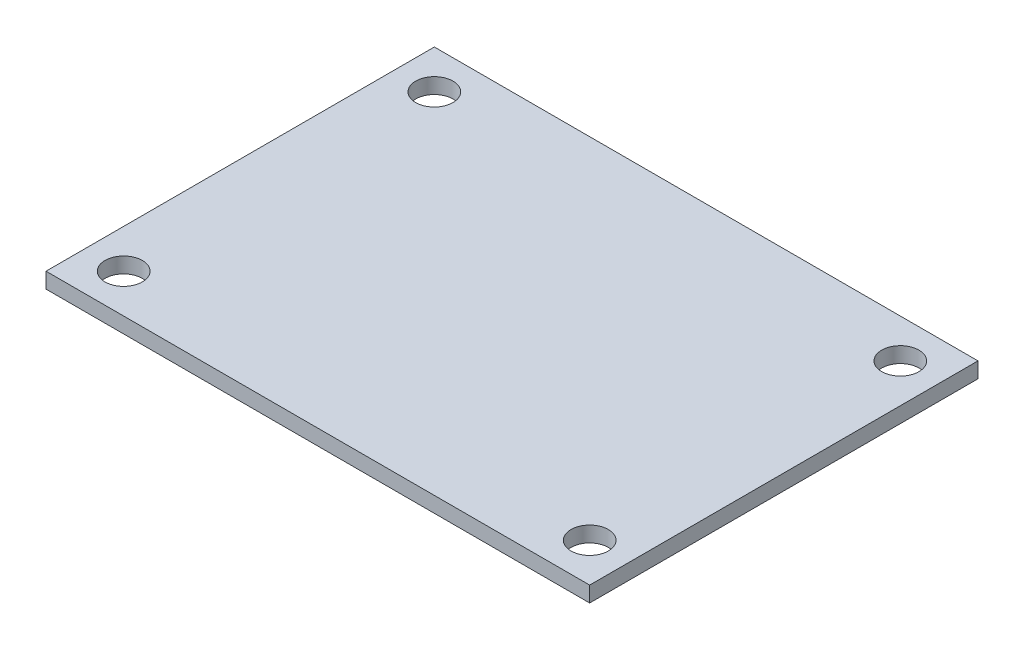
ISO-10303-21;
HEADER;
FILE_DESCRIPTION(('STEP AP214'),'2;1');
FILE_NAME('part.step','',(''),(''),'','','');
FILE_SCHEMA(('AUTOMOTIVE_DESIGN { 1 0 10303 214 1 1 1 1 }'));
ENDSEC;
DATA;
#1=APPLICATION_CONTEXT('core data for automotive mechanical design processes');
#2=APPLICATION_PROTOCOL_DEFINITION('international standard','automotive_design',2000,#1);
#3=PRODUCT_CONTEXT('',#1,'mechanical');
#4=PRODUCT('Part','Part','',(#3));
#5=PRODUCT_RELATED_PRODUCT_CATEGORY('part','',(#4));
#6=PRODUCT_DEFINITION_FORMATION('','',#4);
#7=PRODUCT_DEFINITION_CONTEXT('part definition',#1,'design');
#8=PRODUCT_DEFINITION('design','',#6,#7);
#9=PRODUCT_DEFINITION_SHAPE('','',#8);
#10=(LENGTH_UNIT() NAMED_UNIT(*) SI_UNIT(.MILLI.,.METRE.));
#11=(NAMED_UNIT(*) PLANE_ANGLE_UNIT() SI_UNIT($,.RADIAN.));
#12=(NAMED_UNIT(*) SI_UNIT($,.STERADIAN.) SOLID_ANGLE_UNIT());
#13=UNCERTAINTY_MEASURE_WITH_UNIT(LENGTH_MEASURE(1.E-05),#10,'distance_accuracy_value','');
#14=(GEOMETRIC_REPRESENTATION_CONTEXT(3) GLOBAL_UNCERTAINTY_ASSIGNED_CONTEXT((#13)) GLOBAL_UNIT_ASSIGNED_CONTEXT((#10,
#11,#12)) REPRESENTATION_CONTEXT('',''));
#15=CARTESIAN_POINT('',(0.,0.,0.));
#16=DIRECTION('',(0.,0.,1.));
#17=DIRECTION('',(1.,0.,0.));
#18=AXIS2_PLACEMENT_3D('',#15,#16,#17);
#19=CARTESIAN_POINT('',(15.,-0.000999999999999916,10.));
#20=DIRECTION('',(0.,1.,0.));
#21=DIRECTION('',(0.,0.,1.));
#22=AXIS2_PLACEMENT_3D('',#19,#20,#21);
#23=CYLINDRICAL_SURFACE('',#22,1.2);
#24=CARTESIAN_POINT('',(15.,1.,10.));
#25=DIRECTION('',(0.,1.,0.));
#26=DIRECTION('',(0.,0.,1.));
#27=AXIS2_PLACEMENT_3D('',#24,#25,#26);
#28=CIRCLE('',#27,1.2);
#29=CARTESIAN_POINT('',(15.,1.,11.2));
#30=VERTEX_POINT('',#29);
#31=EDGE_CURVE('E43',#30,#30,#28,.T.);
#32=ORIENTED_EDGE('',*,*,#31,.T.);
#33=EDGE_LOOP('',(#32));
#34=FACE_BOUND('',#33,.T.);
#35=CARTESIAN_POINT('',(15.,0.,10.));
#36=DIRECTION('',(0.,1.,0.));
#37=DIRECTION('',(0.,0.,1.));
#38=AXIS2_PLACEMENT_3D('',#35,#36,#37);
#39=CIRCLE('',#38,1.2);
#40=CARTESIAN_POINT('',(15.,0.,11.2));
#41=VERTEX_POINT('',#40);
#42=EDGE_CURVE('E11',#41,#41,#39,.F.);
#43=ORIENTED_EDGE('',*,*,#42,.T.);
#44=EDGE_LOOP('',(#43));
#45=FACE_BOUND('',#44,.T.);
#46=ADVANCED_FACE('F35',(#34,#45),#23,.F.);
#47=CARTESIAN_POINT('',(-15.,-0.000999999999999916,10.));
#48=DIRECTION('',(0.,1.,0.));
#49=DIRECTION('',(0.,0.,1.));
#50=AXIS2_PLACEMENT_3D('',#47,#48,#49);
#51=CYLINDRICAL_SURFACE('',#50,1.2);
#52=CARTESIAN_POINT('',(-15.,1.,10.));
#53=DIRECTION('',(0.,1.,0.));
#54=DIRECTION('',(0.,0.,1.));
#55=AXIS2_PLACEMENT_3D('',#52,#53,#54);
#56=CIRCLE('',#55,1.2);
#57=CARTESIAN_POINT('',(-15.,1.,11.2));
#58=VERTEX_POINT('',#57);
#59=EDGE_CURVE('E113',#58,#58,#56,.T.);
#60=ORIENTED_EDGE('',*,*,#59,.T.);
#61=EDGE_LOOP('',(#60));
#62=FACE_BOUND('',#61,.T.);
#63=CARTESIAN_POINT('',(-15.,0.,10.));
#64=DIRECTION('',(0.,1.,0.));
#65=DIRECTION('',(0.,0.,1.));
#66=AXIS2_PLACEMENT_3D('',#63,#64,#65);
#67=CIRCLE('',#66,1.2);
#68=CARTESIAN_POINT('',(-15.,0.,11.2));
#69=VERTEX_POINT('',#68);
#70=EDGE_CURVE('E116',#69,#69,#67,.F.);
#71=ORIENTED_EDGE('',*,*,#70,.T.);
#72=EDGE_LOOP('',(#71));
#73=FACE_BOUND('',#72,.T.);
#74=ADVANCED_FACE('F140',(#62,#73),#51,.F.);
#75=CARTESIAN_POINT('',(17.5,1.,-12.5));
#76=DIRECTION('',(-1.,0.,0.));
#77=DIRECTION('',(0.,0.,1.));
#78=AXIS2_PLACEMENT_3D('',#75,#76,#77);
#79=PLANE('',#78);
#80=DIRECTION('',(0.,0.,-1.));
#81=VECTOR('',#80,1.);
#82=CARTESIAN_POINT('',(17.5,0.,-12.5));
#83=LINE('',#82,#81);
#84=CARTESIAN_POINT('',(17.5,0.,12.5));
#85=VERTEX_POINT('',#84);
#86=CARTESIAN_POINT('',(17.5,0.,-12.5));
#87=VERTEX_POINT('',#86);
#88=EDGE_CURVE('E103',#85,#87,#83,.T.);
#89=ORIENTED_EDGE('',*,*,#88,.T.);
#90=DIRECTION('',(0.,-1.,0.));
#91=VECTOR('',#90,1.);
#92=CARTESIAN_POINT('',(17.5,1.,-12.5));
#93=LINE('',#92,#91);
#94=CARTESIAN_POINT('',(17.5,1.,-12.5));
#95=VERTEX_POINT('',#94);
#96=EDGE_CURVE('E94',#95,#87,#93,.T.);
#97=ORIENTED_EDGE('',*,*,#96,.F.);
#98=DIRECTION('',(0.,0.,-1.));
#99=VECTOR('',#98,1.);
#100=CARTESIAN_POINT('',(17.5,1.,-12.5));
#101=LINE('',#100,#99);
#102=CARTESIAN_POINT('',(17.5,1.,12.5));
#103=VERTEX_POINT('',#102);
#104=EDGE_CURVE('E88',#103,#95,#101,.T.);
#105=ORIENTED_EDGE('',*,*,#104,.F.);
#106=DIRECTION('',(0.,-1.,0.));
#107=VECTOR('',#106,1.);
#108=CARTESIAN_POINT('',(17.5,1.,12.5));
#109=LINE('',#108,#107);
#110=EDGE_CURVE('E99',#103,#85,#109,.T.);
#111=ORIENTED_EDGE('',*,*,#110,.T.);
#112=EDGE_LOOP('',(#89,#97,#105,#111));
#113=FACE_BOUND('',#112,.T.);
#114=ADVANCED_FACE('F144',(#113),#79,.F.);
#115=CARTESIAN_POINT('',(-17.5,1.,-12.5));
#116=DIRECTION('',(0.,0.,1.));
#117=DIRECTION('',(1.,0.,0.));
#118=AXIS2_PLACEMENT_3D('',#115,#116,#117);
#119=PLANE('',#118);
#120=DIRECTION('',(-1.,0.,0.));
#121=VECTOR('',#120,1.);
#122=CARTESIAN_POINT('',(-17.5,0.,-12.5));
#123=LINE('',#122,#121);
#124=CARTESIAN_POINT('',(-17.5,0.,-12.5));
#125=VERTEX_POINT('',#124);
#126=EDGE_CURVE('E93',#87,#125,#123,.T.);
#127=ORIENTED_EDGE('',*,*,#126,.T.);
#128=DIRECTION('',(0.,-1.,0.));
#129=VECTOR('',#128,1.);
#130=CARTESIAN_POINT('',(-17.5,1.,-12.5));
#131=LINE('',#130,#129);
#132=CARTESIAN_POINT('',(-17.5,1.,-12.5));
#133=VERTEX_POINT('',#132);
#134=EDGE_CURVE('E91',#133,#125,#131,.T.);
#135=ORIENTED_EDGE('',*,*,#134,.F.);
#136=DIRECTION('',(-1.,0.,0.));
#137=VECTOR('',#136,1.);
#138=CARTESIAN_POINT('',(-17.5,1.,-12.5));
#139=LINE('',#138,#137);
#140=EDGE_CURVE('E82',#95,#133,#139,.T.);
#141=ORIENTED_EDGE('',*,*,#140,.F.);
#142=ORIENTED_EDGE('',*,*,#96,.T.);
#143=EDGE_LOOP('',(#127,#135,#141,#142));
#144=FACE_BOUND('',#143,.T.);
#145=ADVANCED_FACE('F92',(#144),#119,.F.);
#146=CARTESIAN_POINT('',(-17.5,1.,-12.5));
#147=DIRECTION('',(1.,0.,0.));
#148=DIRECTION('',(0.,0.,-1.));
#149=AXIS2_PLACEMENT_3D('',#146,#147,#148);
#150=PLANE('',#149);
#151=DIRECTION('',(0.,0.,1.));
#152=VECTOR('',#151,1.);
#153=CARTESIAN_POINT('',(-17.5,0.,-12.5));
#154=LINE('',#153,#152);
#155=CARTESIAN_POINT('',(-17.5,0.,12.5));
#156=VERTEX_POINT('',#155);
#157=EDGE_CURVE('E68',#125,#156,#154,.T.);
#158=ORIENTED_EDGE('',*,*,#157,.T.);
#159=DIRECTION('',(0.,-1.,0.));
#160=VECTOR('',#159,1.);
#161=CARTESIAN_POINT('',(-17.5,1.,12.5));
#162=LINE('',#161,#160);
#163=CARTESIAN_POINT('',(-17.5,1.,12.5));
#164=VERTEX_POINT('',#163);
#165=EDGE_CURVE('E95',#164,#156,#162,.T.);
#166=ORIENTED_EDGE('',*,*,#165,.F.);
#167=DIRECTION('',(0.,0.,1.));
#168=VECTOR('',#167,1.);
#169=CARTESIAN_POINT('',(-17.5,1.,-12.5));
#170=LINE('',#169,#168);
#171=EDGE_CURVE('E86',#133,#164,#170,.T.);
#172=ORIENTED_EDGE('',*,*,#171,.F.);
#173=ORIENTED_EDGE('',*,*,#134,.T.);
#174=EDGE_LOOP('',(#158,#166,#172,#173));
#175=FACE_BOUND('',#174,.T.);
#176=ADVANCED_FACE('F97',(#175),#150,.F.);
#177=CARTESIAN_POINT('',(-17.5,1.,12.5));
#178=DIRECTION('',(0.,0.,-1.));
#179=DIRECTION('',(-1.,0.,0.));
#180=AXIS2_PLACEMENT_3D('',#177,#178,#179);
#181=PLANE('',#180);
#182=DIRECTION('',(1.,0.,0.));
#183=VECTOR('',#182,1.);
#184=CARTESIAN_POINT('',(-17.5,0.,12.5));
#185=LINE('',#184,#183);
#186=EDGE_CURVE('E74',#156,#85,#185,.T.);
#187=ORIENTED_EDGE('',*,*,#186,.T.);
#188=ORIENTED_EDGE('',*,*,#110,.F.);
#189=DIRECTION('',(1.,0.,0.));
#190=VECTOR('',#189,1.);
#191=CARTESIAN_POINT('',(-17.5,1.,12.5));
#192=LINE('',#191,#190);
#193=EDGE_CURVE('E51',#164,#103,#192,.T.);
#194=ORIENTED_EDGE('',*,*,#193,.F.);
#195=ORIENTED_EDGE('',*,*,#165,.T.);
#196=EDGE_LOOP('',(#187,#188,#194,#195));
#197=FACE_BOUND('',#196,.T.);
#198=ADVANCED_FACE('F125',(#197),#181,.F.);
#199=CARTESIAN_POINT('',(0.,1.,0.));
#200=DIRECTION('',(0.,1.,0.));
#201=DIRECTION('',(0.,0.,1.));
#202=AXIS2_PLACEMENT_3D('',#199,#200,#201);
#203=PLANE('',#202);
#204=CARTESIAN_POINT('',(15.,1.,-10.));
#205=DIRECTION('',(0.,1.,0.));
#206=DIRECTION('',(0.,0.,1.));
#207=AXIS2_PLACEMENT_3D('',#204,#205,#206);
#208=CIRCLE('',#207,1.2);
#209=CARTESIAN_POINT('',(15.,1.,-8.8));
#210=VERTEX_POINT('',#209);
#211=EDGE_CURVE('E206',#210,#210,#208,.T.);
#212=ORIENTED_EDGE('',*,*,#211,.F.);
#213=EDGE_LOOP('',(#212));
#214=FACE_BOUND('',#213,.T.);
#215=CARTESIAN_POINT('',(-15.,1.,-10.));
#216=DIRECTION('',(0.,1.,0.));
#217=DIRECTION('',(0.,0.,1.));
#218=AXIS2_PLACEMENT_3D('',#215,#216,#217);
#219=CIRCLE('',#218,1.2);
#220=CARTESIAN_POINT('',(-15.,1.,-8.8));
#221=VERTEX_POINT('',#220);
#222=EDGE_CURVE('E210',#221,#221,#219,.T.);
#223=ORIENTED_EDGE('',*,*,#222,.F.);
#224=EDGE_LOOP('',(#223));
#225=FACE_BOUND('',#224,.T.);
#226=ORIENTED_EDGE('',*,*,#104,.T.);
#227=ORIENTED_EDGE('',*,*,#140,.T.);
#228=ORIENTED_EDGE('',*,*,#171,.T.);
#229=ORIENTED_EDGE('',*,*,#193,.T.);
#230=EDGE_LOOP('',(#226,#227,#228,#229));
#231=FACE_BOUND('',#230,.T.);
#232=ORIENTED_EDGE('',*,*,#59,.F.);
#233=EDGE_LOOP('',(#232));
#234=FACE_BOUND('',#233,.T.);
#235=ORIENTED_EDGE('',*,*,#31,.F.);
#236=EDGE_LOOP('',(#235));
#237=FACE_BOUND('',#236,.T.);
#238=ADVANCED_FACE('F83',(#214,#225,#231,#234,#237),#203,.T.);
#239=CARTESIAN_POINT('',(0.,0.,0.));
#240=DIRECTION('',(0.,1.,0.));
#241=DIRECTION('',(0.,0.,1.));
#242=AXIS2_PLACEMENT_3D('',#239,#240,#241);
#243=PLANE('',#242);
#244=CARTESIAN_POINT('',(15.,0.,-10.));
#245=DIRECTION('',(0.,1.,0.));
#246=DIRECTION('',(0.,0.,1.));
#247=AXIS2_PLACEMENT_3D('',#244,#245,#246);
#248=CIRCLE('',#247,1.2);
#249=CARTESIAN_POINT('',(15.,0.,-8.8));
#250=VERTEX_POINT('',#249);
#251=EDGE_CURVE('E209',#250,#250,#248,.F.);
#252=ORIENTED_EDGE('',*,*,#251,.F.);
#253=EDGE_LOOP('',(#252));
#254=FACE_BOUND('',#253,.T.);
#255=CARTESIAN_POINT('',(-15.,0.,-10.));
#256=DIRECTION('',(0.,1.,0.));
#257=DIRECTION('',(0.,0.,1.));
#258=AXIS2_PLACEMENT_3D('',#255,#256,#257);
#259=CIRCLE('',#258,1.2);
#260=CARTESIAN_POINT('',(-15.,0.,-8.8));
#261=VERTEX_POINT('',#260);
#262=EDGE_CURVE('E106',#261,#261,#259,.F.);
#263=ORIENTED_EDGE('',*,*,#262,.F.);
#264=EDGE_LOOP('',(#263));
#265=FACE_BOUND('',#264,.T.);
#266=ORIENTED_EDGE('',*,*,#88,.F.);
#267=ORIENTED_EDGE('',*,*,#186,.F.);
#268=ORIENTED_EDGE('',*,*,#157,.F.);
#269=ORIENTED_EDGE('',*,*,#126,.F.);
#270=EDGE_LOOP('',(#266,#267,#268,#269));
#271=FACE_BOUND('',#270,.T.);
#272=ORIENTED_EDGE('',*,*,#70,.F.);
#273=EDGE_LOOP('',(#272));
#274=FACE_BOUND('',#273,.T.);
#275=ORIENTED_EDGE('',*,*,#42,.F.);
#276=EDGE_LOOP('',(#275));
#277=FACE_BOUND('',#276,.T.);
#278=ADVANCED_FACE('F124',(#254,#265,#271,#274,#277),#243,.F.);
#279=CARTESIAN_POINT('',(-15.,-0.000999999999999916,-10.));
#280=DIRECTION('',(0.,1.,0.));
#281=DIRECTION('',(0.,0.,1.));
#282=AXIS2_PLACEMENT_3D('',#279,#280,#281);
#283=CYLINDRICAL_SURFACE('',#282,1.2);
#284=ORIENTED_EDGE('',*,*,#222,.T.);
#285=EDGE_LOOP('',(#284));
#286=FACE_BOUND('',#285,.T.);
#287=ORIENTED_EDGE('',*,*,#262,.T.);
#288=EDGE_LOOP('',(#287));
#289=FACE_BOUND('',#288,.T.);
#290=ADVANCED_FACE('F132',(#286,#289),#283,.F.);
#291=CARTESIAN_POINT('',(15.,-0.000999999999999916,-10.));
#292=DIRECTION('',(0.,1.,0.));
#293=DIRECTION('',(0.,0.,1.));
#294=AXIS2_PLACEMENT_3D('',#291,#292,#293);
#295=CYLINDRICAL_SURFACE('',#294,1.2);
#296=ORIENTED_EDGE('',*,*,#211,.T.);
#297=EDGE_LOOP('',(#296));
#298=FACE_BOUND('',#297,.T.);
#299=ORIENTED_EDGE('',*,*,#251,.T.);
#300=EDGE_LOOP('',(#299));
#301=FACE_BOUND('',#300,.T.);
#302=ADVANCED_FACE('F173',(#298,#301),#295,.F.);
#303=CLOSED_SHELL('',(#46,#74,#114,#145,#176,#198,#238,#278,#290,#302));
#304=MANIFOLD_SOLID_BREP('B2',#303);
#305=ADVANCED_BREP_SHAPE_REPRESENTATION('',(#18,#304),#14);
#306=SHAPE_DEFINITION_REPRESENTATION(#9,#305);
ENDSEC;
END-ISO-10303-21;
